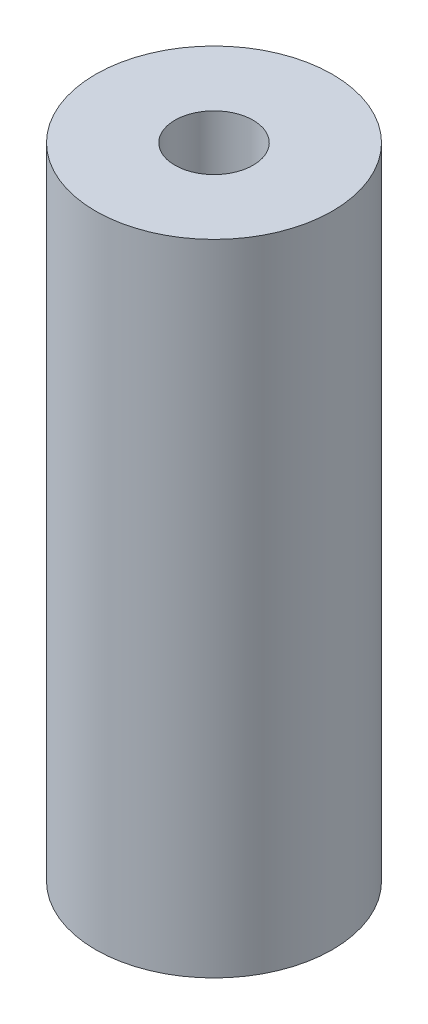
ISO-10303-21;
HEADER;
FILE_DESCRIPTION(('STEP AP214'),'2;1');
FILE_NAME('part.step','',(''),(''),'','','');
FILE_SCHEMA(('AUTOMOTIVE_DESIGN { 1 0 10303 214 1 1 1 1 }'));
ENDSEC;
DATA;
#1=APPLICATION_CONTEXT('core data for automotive mechanical design processes');
#2=APPLICATION_PROTOCOL_DEFINITION('international standard','automotive_design',2000,#1);
#3=PRODUCT_CONTEXT('',#1,'mechanical');
#4=PRODUCT('Part','Part','',(#3));
#5=PRODUCT_RELATED_PRODUCT_CATEGORY('part','',(#4));
#6=PRODUCT_DEFINITION_FORMATION('','',#4);
#7=PRODUCT_DEFINITION_CONTEXT('part definition',#1,'design');
#8=PRODUCT_DEFINITION('design','',#6,#7);
#9=PRODUCT_DEFINITION_SHAPE('','',#8);
#10=(LENGTH_UNIT() NAMED_UNIT(*) SI_UNIT(.MILLI.,.METRE.));
#11=(NAMED_UNIT(*) PLANE_ANGLE_UNIT() SI_UNIT($,.RADIAN.));
#12=(NAMED_UNIT(*) SI_UNIT($,.STERADIAN.) SOLID_ANGLE_UNIT());
#13=UNCERTAINTY_MEASURE_WITH_UNIT(LENGTH_MEASURE(1.E-05),#10,'distance_accuracy_value','');
#14=(GEOMETRIC_REPRESENTATION_CONTEXT(3) GLOBAL_UNCERTAINTY_ASSIGNED_CONTEXT((#13)) GLOBAL_UNIT_ASSIGNED_CONTEXT((#10,
#11,#12)) REPRESENTATION_CONTEXT('',''));
#15=CARTESIAN_POINT('',(0.,0.,0.));
#16=DIRECTION('',(0.,0.,1.));
#17=DIRECTION('',(1.,0.,0.));
#18=AXIS2_PLACEMENT_3D('',#15,#16,#17);
#19=CARTESIAN_POINT('',(0.,27.,0.));
#20=DIRECTION('',(0.,-1.,0.));
#21=DIRECTION('',(0.,0.,-1.));
#22=AXIS2_PLACEMENT_3D('',#19,#20,#21);
#23=CYLINDRICAL_SURFACE('',#22,5.);
#24=CARTESIAN_POINT('',(0.,27.,0.));
#25=DIRECTION('',(0.,1.,0.));
#26=DIRECTION('',(0.,0.,1.));
#27=AXIS2_PLACEMENT_3D('',#24,#25,#26);
#28=CIRCLE('',#27,5.);
#29=CARTESIAN_POINT('',(0.,27.,5.));
#30=VERTEX_POINT('',#29);
#31=EDGE_CURVE('E10',#30,#30,#28,.T.);
#32=ORIENTED_EDGE('',*,*,#31,.F.);
#33=EDGE_LOOP('',(#32));
#34=FACE_BOUND('',#33,.T.);
#35=CARTESIAN_POINT('',(0.,0.,0.));
#36=DIRECTION('',(0.,1.,0.));
#37=DIRECTION('',(0.,0.,1.));
#38=AXIS2_PLACEMENT_3D('',#35,#36,#37);
#39=CIRCLE('',#38,5.);
#40=CARTESIAN_POINT('',(0.,0.,5.));
#41=VERTEX_POINT('',#40);
#42=EDGE_CURVE('E40',#41,#41,#39,.T.);
#43=ORIENTED_EDGE('',*,*,#42,.T.);
#44=EDGE_LOOP('',(#43));
#45=FACE_BOUND('',#44,.T.);
#46=ADVANCED_FACE('F37',(#34,#45),#23,.T.);
#47=CARTESIAN_POINT('',(0.,27.,0.));
#48=DIRECTION('',(0.,1.,0.));
#49=DIRECTION('',(0.,0.,1.));
#50=AXIS2_PLACEMENT_3D('',#47,#48,#49);
#51=PLANE('',#50);
#52=CARTESIAN_POINT('',(0.,27.,0.));
#53=DIRECTION('',(0.,1.,0.));
#54=DIRECTION('',(0.,0.,1.));
#55=AXIS2_PLACEMENT_3D('',#52,#53,#54);
#56=CIRCLE('',#55,1.65);
#57=CARTESIAN_POINT('',(0.,27.,1.65));
#58=VERTEX_POINT('',#57);
#59=EDGE_CURVE('E51',#58,#58,#56,.T.);
#60=ORIENTED_EDGE('',*,*,#59,.F.);
#61=EDGE_LOOP('',(#60));
#62=FACE_BOUND('',#61,.T.);
#63=ORIENTED_EDGE('',*,*,#31,.T.);
#64=EDGE_LOOP('',(#63));
#65=FACE_BOUND('',#64,.T.);
#66=ADVANCED_FACE('F57',(#62,#65),#51,.T.);
#67=CARTESIAN_POINT('',(0.,0.,0.));
#68=DIRECTION('',(0.,1.,0.));
#69=DIRECTION('',(0.,0.,1.));
#70=AXIS2_PLACEMENT_3D('',#67,#68,#69);
#71=PLANE('',#70);
#72=CARTESIAN_POINT('',(0.,0.,0.));
#73=DIRECTION('',(0.,1.,0.));
#74=DIRECTION('',(0.,0.,1.));
#75=AXIS2_PLACEMENT_3D('',#72,#73,#74);
#76=CIRCLE('',#75,1.65);
#77=CARTESIAN_POINT('',(0.,0.,1.65));
#78=VERTEX_POINT('',#77);
#79=EDGE_CURVE('E47',#78,#78,#76,.T.);
#80=ORIENTED_EDGE('',*,*,#79,.T.);
#81=EDGE_LOOP('',(#80));
#82=FACE_BOUND('',#81,.T.);
#83=ORIENTED_EDGE('',*,*,#42,.F.);
#84=EDGE_LOOP('',(#83));
#85=FACE_BOUND('',#84,.T.);
#86=ADVANCED_FACE('F59',(#82,#85),#71,.F.);
#87=CARTESIAN_POINT('',(0.,27.,0.));
#88=DIRECTION('',(0.,1.,0.));
#89=DIRECTION('',(0.,0.,1.));
#90=AXIS2_PLACEMENT_3D('',#87,#88,#89);
#91=CYLINDRICAL_SURFACE('',#90,1.65);
#92=ORIENTED_EDGE('',*,*,#79,.F.);
#93=EDGE_LOOP('',(#92));
#94=FACE_BOUND('',#93,.T.);
#95=ORIENTED_EDGE('',*,*,#59,.T.);
#96=EDGE_LOOP('',(#95));
#97=FACE_BOUND('',#96,.T.);
#98=ADVANCED_FACE('F55',(#94,#97),#91,.F.);
#99=CLOSED_SHELL('',(#46,#66,#86,#98));
#100=MANIFOLD_SOLID_BREP('B2',#99);
#101=ADVANCED_BREP_SHAPE_REPRESENTATION('',(#18,#100),#14);
#102=SHAPE_DEFINITION_REPRESENTATION(#9,#101);
ENDSEC;
END-ISO-10303-21;
